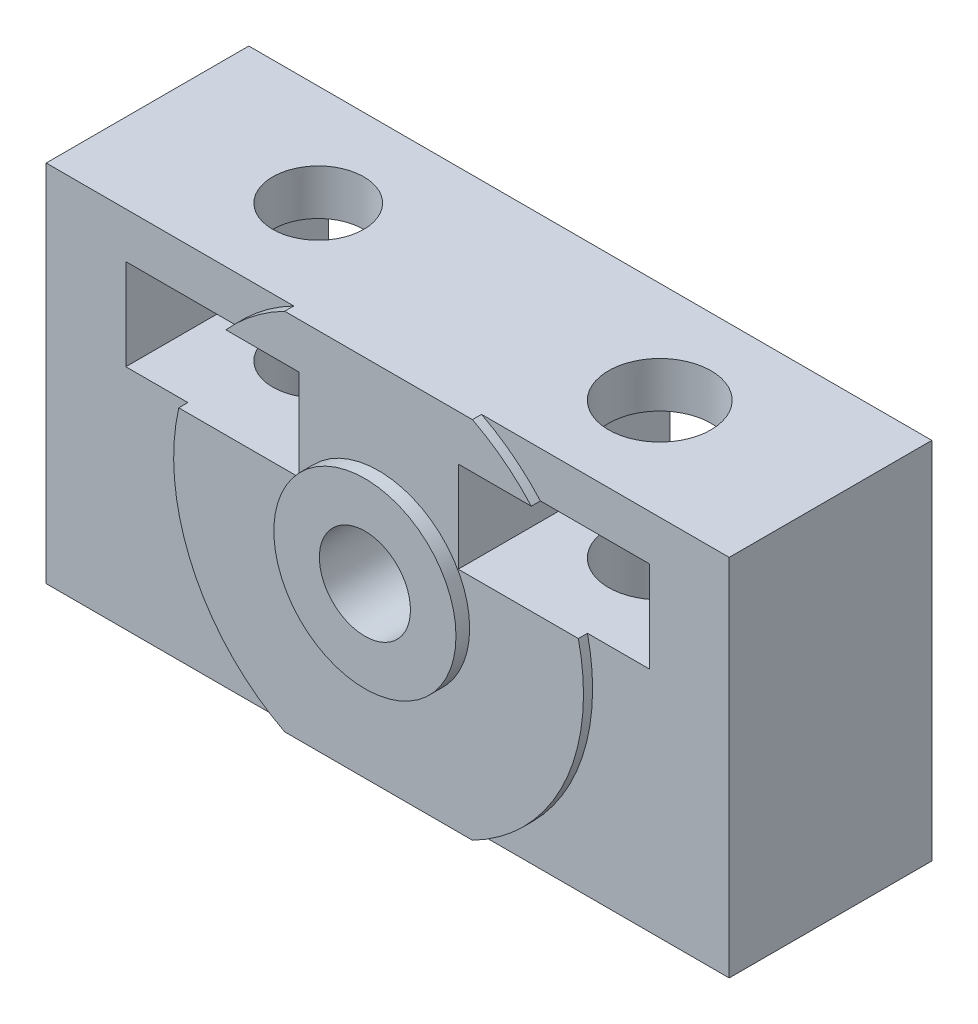
ISO-10303-21;
HEADER;
FILE_DESCRIPTION(('STEP AP214'),'2;1');
FILE_NAME('part.step','',(''),(''),'','','');
FILE_SCHEMA(('AUTOMOTIVE_DESIGN { 1 0 10303 214 1 1 1 1 }'));
ENDSEC;
DATA;
#1=APPLICATION_CONTEXT('core data for automotive mechanical design processes');
#2=APPLICATION_PROTOCOL_DEFINITION('international standard','automotive_design',2000,#1);
#3=PRODUCT_CONTEXT('',#1,'mechanical');
#4=PRODUCT('Part','Part','',(#3));
#5=PRODUCT_RELATED_PRODUCT_CATEGORY('part','',(#4));
#6=PRODUCT_DEFINITION_FORMATION('','',#4);
#7=PRODUCT_DEFINITION_CONTEXT('part definition',#1,'design');
#8=PRODUCT_DEFINITION('design','',#6,#7);
#9=PRODUCT_DEFINITION_SHAPE('','',#8);
#10=(LENGTH_UNIT() NAMED_UNIT(*) SI_UNIT(.MILLI.,.METRE.));
#11=(NAMED_UNIT(*) PLANE_ANGLE_UNIT() SI_UNIT($,.RADIAN.));
#12=(NAMED_UNIT(*) SI_UNIT($,.STERADIAN.) SOLID_ANGLE_UNIT());
#13=UNCERTAINTY_MEASURE_WITH_UNIT(LENGTH_MEASURE(1.E-05),#10,'distance_accuracy_value','');
#14=(GEOMETRIC_REPRESENTATION_CONTEXT(3) GLOBAL_UNCERTAINTY_ASSIGNED_CONTEXT((#13)) GLOBAL_UNIT_ASSIGNED_CONTEXT((#10,
#11,#12)) REPRESENTATION_CONTEXT('',''));
#15=CARTESIAN_POINT('',(0.,0.,0.));
#16=DIRECTION('',(0.,0.,1.));
#17=DIRECTION('',(1.,0.,0.));
#18=AXIS2_PLACEMENT_3D('',#15,#16,#17);
#19=CARTESIAN_POINT('',(-4.,0.,9.3));
#20=DIRECTION('',(0.,0.,-1.));
#21=DIRECTION('',(-1.,0.,0.));
#22=AXIS2_PLACEMENT_3D('',#19,#20,#21);
#23=PLANE('',#22);
#24=CARTESIAN_POINT('',(0.,0.,9.3));
#25=DIRECTION('',(0.,0.,1.));
#26=DIRECTION('',(1.,0.,0.));
#27=AXIS2_PLACEMENT_3D('',#24,#25,#26);
#28=CIRCLE('',#27,4.);
#29=CARTESIAN_POINT('',(4.,0.,9.3));
#30=VERTEX_POINT('',#29);
#31=EDGE_CURVE('E281',#30,#30,#28,.T.);
#32=ORIENTED_EDGE('',*,*,#31,.F.);
#33=EDGE_LOOP('',(#32));
#34=FACE_BOUND('',#33,.T.);
#35=DIRECTION('',(-1.,0.,0.));
#36=VECTOR('',#35,1.);
#37=CARTESIAN_POINT('',(-4.,-8.,9.3));
#38=LINE('',#37,#36);
#39=CARTESIAN_POINT('',(4.12310562561766,-8.,9.29999999999999));
#40=VERTEX_POINT('',#39);
#41=CARTESIAN_POINT('',(-4.12310562561766,-8.,9.3));
#42=VERTEX_POINT('',#41);
#43=EDGE_CURVE('E46',#40,#42,#38,.T.);
#44=ORIENTED_EDGE('',*,*,#43,.F.);
#45=CARTESIAN_POINT('',(0.,0.,9.3));
#46=DIRECTION('',(0.,0.,1.));
#47=DIRECTION('',(1.,0.,0.));
#48=AXIS2_PLACEMENT_3D('',#45,#46,#47);
#49=CIRCLE('',#48,9.);
#50=CARTESIAN_POINT('',(8.77496438739212,2.,9.29999999999999));
#51=VERTEX_POINT('',#50);
#52=EDGE_CURVE('E277',#40,#51,#49,.T.);
#53=ORIENTED_EDGE('',*,*,#52,.T.);
#54=DIRECTION('',(-1.,0.,0.));
#55=VECTOR('',#54,1.);
#56=CARTESIAN_POINT('',(-4.,2.,9.3));
#57=LINE('',#56,#55);
#58=CARTESIAN_POINT('',(3.5,2.,9.29999999999999));
#59=VERTEX_POINT('',#58);
#60=EDGE_CURVE('E479',#51,#59,#57,.T.);
#61=ORIENTED_EDGE('',*,*,#60,.T.);
#62=DIRECTION('',(0.,1.,0.));
#63=VECTOR('',#62,1.);
#64=CARTESIAN_POINT('',(3.5,0.,9.29999999999999));
#65=LINE('',#64,#63);
#66=CARTESIAN_POINT('',(3.5,6.,9.29999999999999));
#67=VERTEX_POINT('',#66);
#68=EDGE_CURVE('E245',#59,#67,#65,.T.);
#69=ORIENTED_EDGE('',*,*,#68,.T.);
#70=DIRECTION('',(1.,0.,0.));
#71=VECTOR('',#70,1.);
#72=CARTESIAN_POINT('',(-4.,6.,9.3));
#73=LINE('',#72,#71);
#74=CARTESIAN_POINT('',(6.70820393249937,6.,9.29999999999999));
#75=VERTEX_POINT('',#74);
#76=EDGE_CURVE('E276',#67,#75,#73,.T.);
#77=ORIENTED_EDGE('',*,*,#76,.T.);
#78=CARTESIAN_POINT('',(4.12310562561766,8.,9.3));
#79=VERTEX_POINT('',#78);
#80=EDGE_CURVE('E271',#75,#79,#49,.T.);
#81=ORIENTED_EDGE('',*,*,#80,.T.);
#82=DIRECTION('',(1.,0.,0.));
#83=VECTOR('',#82,1.);
#84=CARTESIAN_POINT('',(-4.,8.,9.3));
#85=LINE('',#84,#83);
#86=CARTESIAN_POINT('',(-4.12310562561767,8.,9.3));
#87=VERTEX_POINT('',#86);
#88=EDGE_CURVE('E175',#87,#79,#85,.T.);
#89=ORIENTED_EDGE('',*,*,#88,.F.);
#90=CARTESIAN_POINT('',(-6.70820393249937,6.,9.29999999999999));
#91=VERTEX_POINT('',#90);
#92=EDGE_CURVE('E227',#87,#91,#49,.T.);
#93=ORIENTED_EDGE('',*,*,#92,.T.);
#94=DIRECTION('',(1.,0.,0.));
#95=VECTOR('',#94,1.);
#96=CARTESIAN_POINT('',(-4.,6.,9.3));
#97=LINE('',#96,#95);
#98=CARTESIAN_POINT('',(-3.5,6.,9.3));
#99=VERTEX_POINT('',#98);
#100=EDGE_CURVE('E461',#91,#99,#97,.T.);
#101=ORIENTED_EDGE('',*,*,#100,.T.);
#102=DIRECTION('',(0.,-1.,0.));
#103=VECTOR('',#102,1.);
#104=CARTESIAN_POINT('',(-3.5,0.,9.3));
#105=LINE('',#104,#103);
#106=CARTESIAN_POINT('',(-3.5,2.,9.3));
#107=VERTEX_POINT('',#106);
#108=EDGE_CURVE('E242',#99,#107,#105,.T.);
#109=ORIENTED_EDGE('',*,*,#108,.T.);
#110=DIRECTION('',(-1.,0.,0.));
#111=VECTOR('',#110,1.);
#112=CARTESIAN_POINT('',(-4.,2.,9.3));
#113=LINE('',#112,#111);
#114=CARTESIAN_POINT('',(-8.77496438739212,2.,9.29999999999999));
#115=VERTEX_POINT('',#114);
#116=EDGE_CURVE('E457',#107,#115,#113,.T.);
#117=ORIENTED_EDGE('',*,*,#116,.T.);
#118=EDGE_CURVE('E279',#115,#42,#49,.T.);
#119=ORIENTED_EDGE('',*,*,#118,.T.);
#120=EDGE_LOOP('',(#44,#53,#61,#69,#77,#81,#89,#93,#101,#109,#117,#119));
#121=FACE_BOUND('',#120,.T.);
#122=ADVANCED_FACE('F32',(#34,#121),#23,.F.);
#123=CARTESIAN_POINT('',(0.,0.,8.9));
#124=DIRECTION('',(0.,0.,1.));
#125=DIRECTION('',(1.,0.,0.));
#126=AXIS2_PLACEMENT_3D('',#123,#124,#125);
#127=CYLINDRICAL_SURFACE('',#126,9.);
#128=DIRECTION('',(0.,0.,1.));
#129=VECTOR('',#128,1.);
#130=CARTESIAN_POINT('',(4.12310562561766,-8.,8.9));
#131=LINE('',#130,#129);
#132=CARTESIAN_POINT('',(4.12310562561766,-8.,8.9));
#133=VERTEX_POINT('',#132);
#134=EDGE_CURVE('E11',#133,#40,#131,.T.);
#135=ORIENTED_EDGE('',*,*,#134,.F.);
#136=CARTESIAN_POINT('',(0.,0.,8.9));
#137=DIRECTION('',(0.,0.,1.));
#138=DIRECTION('',(1.,0.,0.));
#139=AXIS2_PLACEMENT_3D('',#136,#137,#138);
#140=CIRCLE('',#139,9.);
#141=CARTESIAN_POINT('',(8.77496438739212,2.,8.9));
#142=VERTEX_POINT('',#141);
#143=EDGE_CURVE('E184',#133,#142,#140,.T.);
#144=ORIENTED_EDGE('',*,*,#143,.T.);
#145=DIRECTION('',(0.,0.,1.));
#146=VECTOR('',#145,1.);
#147=CARTESIAN_POINT('',(8.77496438739212,2.,8.9));
#148=LINE('',#147,#146);
#149=EDGE_CURVE('E249',#142,#51,#148,.T.);
#150=ORIENTED_EDGE('',*,*,#149,.T.);
#151=ORIENTED_EDGE('',*,*,#52,.F.);
#152=EDGE_LOOP('',(#135,#144,#150,#151));
#153=FACE_BOUND('',#152,.T.);
#154=ADVANCED_FACE('F322',(#153),#127,.T.);
#155=DIRECTION('',(0.,0.,1.));
#156=VECTOR('',#155,1.);
#157=CARTESIAN_POINT('',(-4.12310562561766,-8.,8.90000000000001));
#158=LINE('',#157,#156);
#159=CARTESIAN_POINT('',(-4.12310562561766,-8.,8.9));
#160=VERTEX_POINT('',#159);
#161=EDGE_CURVE('E40',#42,#160,#158,.F.);
#162=ORIENTED_EDGE('',*,*,#161,.F.);
#163=ORIENTED_EDGE('',*,*,#118,.F.);
#164=DIRECTION('',(0.,0.,1.));
#165=VECTOR('',#164,1.);
#166=CARTESIAN_POINT('',(-8.77496438739212,2.,8.90000000000001));
#167=LINE('',#166,#165);
#168=CARTESIAN_POINT('',(-8.77496438739212,2.,8.90000000000001));
#169=VERTEX_POINT('',#168);
#170=EDGE_CURVE('E180',#115,#169,#167,.F.);
#171=ORIENTED_EDGE('',*,*,#170,.T.);
#172=EDGE_CURVE('E178',#169,#160,#140,.T.);
#173=ORIENTED_EDGE('',*,*,#172,.T.);
#174=EDGE_LOOP('',(#162,#163,#171,#173));
#175=FACE_BOUND('',#174,.T.);
#176=ADVANCED_FACE('F179',(#175),#127,.T.);
#177=DIRECTION('',(0.,0.,-1.));
#178=VECTOR('',#177,1.);
#179=CARTESIAN_POINT('',(-4.12310562561766,8.,9.9));
#180=LINE('',#179,#178);
#181=CARTESIAN_POINT('',(-4.12310562561766,8.,8.9));
#182=VERTEX_POINT('',#181);
#183=EDGE_CURVE('E54',#87,#182,#180,.T.);
#184=ORIENTED_EDGE('',*,*,#183,.T.);
#185=CARTESIAN_POINT('',(-6.70820393249937,6.,8.9));
#186=VERTEX_POINT('',#185);
#187=EDGE_CURVE('E183',#182,#186,#140,.T.);
#188=ORIENTED_EDGE('',*,*,#187,.T.);
#189=DIRECTION('',(0.,0.,1.));
#190=VECTOR('',#189,1.);
#191=CARTESIAN_POINT('',(-6.70820393249937,6.,8.90000000000001));
#192=LINE('',#191,#190);
#193=EDGE_CURVE('E240',#186,#91,#192,.T.);
#194=ORIENTED_EDGE('',*,*,#193,.T.);
#195=ORIENTED_EDGE('',*,*,#92,.F.);
#196=EDGE_LOOP('',(#184,#188,#194,#195));
#197=FACE_BOUND('',#196,.T.);
#198=ADVANCED_FACE('F406',(#197),#127,.T.);
#199=DIRECTION('',(0.,0.,-1.));
#200=VECTOR('',#199,1.);
#201=CARTESIAN_POINT('',(4.12310562561766,8.,9.9));
#202=LINE('',#201,#200);
#203=CARTESIAN_POINT('',(4.12310562561766,8.,8.9));
#204=VERTEX_POINT('',#203);
#205=EDGE_CURVE('E262',#79,#204,#202,.T.);
#206=ORIENTED_EDGE('',*,*,#205,.F.);
#207=ORIENTED_EDGE('',*,*,#80,.F.);
#208=DIRECTION('',(0.,0.,1.));
#209=VECTOR('',#208,1.);
#210=CARTESIAN_POINT('',(6.70820393249937,6.,8.9));
#211=LINE('',#210,#209);
#212=CARTESIAN_POINT('',(6.70820393249937,6.,8.9));
#213=VERTEX_POINT('',#212);
#214=EDGE_CURVE('E254',#75,#213,#211,.F.);
#215=ORIENTED_EDGE('',*,*,#214,.T.);
#216=EDGE_CURVE('E186',#213,#204,#140,.T.);
#217=ORIENTED_EDGE('',*,*,#216,.T.);
#218=EDGE_LOOP('',(#206,#207,#215,#217));
#219=FACE_BOUND('',#218,.T.);
#220=ADVANCED_FACE('F269',(#219),#127,.T.);
#221=CARTESIAN_POINT('',(7.5,9.,4.45));
#222=DIRECTION('',(0.,-1.,0.));
#223=DIRECTION('',(1.,0.,0.));
#224=AXIS2_PLACEMENT_3D('',#221,#222,#223);
#225=CYLINDRICAL_SURFACE('',#224,2.25);
#226=CARTESIAN_POINT('',(7.5,6.,4.45));
#227=DIRECTION('',(0.,1.,0.));
#228=DIRECTION('',(-1.,0.,0.));
#229=AXIS2_PLACEMENT_3D('',#226,#227,#228);
#230=CIRCLE('',#229,2.25);
#231=CARTESIAN_POINT('',(5.25,6.,4.45));
#232=VERTEX_POINT('',#231);
#233=EDGE_CURVE('E251',#232,#232,#230,.F.);
#234=ORIENTED_EDGE('',*,*,#233,.T.);
#235=EDGE_LOOP('',(#234));
#236=FACE_BOUND('',#235,.T.);
#237=CARTESIAN_POINT('',(7.5,8.,4.45));
#238=DIRECTION('',(0.,-1.,0.));
#239=DIRECTION('',(1.,0.,0.));
#240=AXIS2_PLACEMENT_3D('',#237,#238,#239);
#241=CIRCLE('',#240,2.25);
#242=CARTESIAN_POINT('',(9.75,8.,4.45));
#243=VERTEX_POINT('',#242);
#244=EDGE_CURVE('E229',#243,#243,#241,.T.);
#245=ORIENTED_EDGE('',*,*,#244,.F.);
#246=EDGE_LOOP('',(#245));
#247=FACE_BOUND('',#246,.T.);
#248=ADVANCED_FACE('F334',(#236,#247),#225,.F.);
#249=CARTESIAN_POINT('',(-7.5,9.,4.45));
#250=DIRECTION('',(0.,-1.,0.));
#251=DIRECTION('',(1.,0.,0.));
#252=AXIS2_PLACEMENT_3D('',#249,#250,#251);
#253=CYLINDRICAL_SURFACE('',#252,2.);
#254=CARTESIAN_POINT('',(-7.5,6.,4.45));
#255=DIRECTION('',(0.,1.,0.));
#256=DIRECTION('',(-1.,0.,0.));
#257=AXIS2_PLACEMENT_3D('',#254,#255,#256);
#258=CIRCLE('',#257,2.);
#259=CARTESIAN_POINT('',(-9.5,6.,4.45));
#260=VERTEX_POINT('',#259);
#261=EDGE_CURVE('E237',#260,#260,#258,.F.);
#262=ORIENTED_EDGE('',*,*,#261,.T.);
#263=EDGE_LOOP('',(#262));
#264=FACE_BOUND('',#263,.T.);
#265=CARTESIAN_POINT('',(-7.5,8.,4.45));
#266=DIRECTION('',(0.,-1.,0.));
#267=DIRECTION('',(1.,0.,0.));
#268=AXIS2_PLACEMENT_3D('',#265,#266,#267);
#269=CIRCLE('',#268,2.);
#270=CARTESIAN_POINT('',(-5.5,8.,4.45));
#271=VERTEX_POINT('',#270);
#272=EDGE_CURVE('E224',#271,#271,#269,.T.);
#273=ORIENTED_EDGE('',*,*,#272,.F.);
#274=EDGE_LOOP('',(#273));
#275=FACE_BOUND('',#274,.T.);
#276=ADVANCED_FACE('F319',(#264,#275),#253,.F.);
#277=CARTESIAN_POINT('',(-15.,8.,8.9));
#278=DIRECTION('',(0.,0.,1.));
#279=DIRECTION('',(1.,0.,0.));
#280=AXIS2_PLACEMENT_3D('',#277,#278,#279);
#281=PLANE('',#280);
#282=DIRECTION('',(-1.,0.,0.));
#283=VECTOR('',#282,1.);
#284=CARTESIAN_POINT('',(-15.,6.,8.9));
#285=LINE('',#284,#283);
#286=CARTESIAN_POINT('',(-11.5,6.,8.9));
#287=VERTEX_POINT('',#286);
#288=EDGE_CURVE('E409',#186,#287,#285,.T.);
#289=ORIENTED_EDGE('',*,*,#288,.F.);
#290=ORIENTED_EDGE('',*,*,#187,.F.);
#291=DIRECTION('',(-1.,0.,0.));
#292=VECTOR('',#291,1.);
#293=CARTESIAN_POINT('',(15.,8.,8.9));
#294=LINE('',#293,#292);
#295=CARTESIAN_POINT('',(-15.,8.,8.9));
#296=VERTEX_POINT('',#295);
#297=EDGE_CURVE('E195',#182,#296,#294,.T.);
#298=ORIENTED_EDGE('',*,*,#297,.T.);
#299=DIRECTION('',(0.,-1.,0.));
#300=VECTOR('',#299,1.);
#301=CARTESIAN_POINT('',(-15.,-8.,8.9));
#302=LINE('',#301,#300);
#303=CARTESIAN_POINT('',(-15.,-8.,8.9));
#304=VERTEX_POINT('',#303);
#305=EDGE_CURVE('E190',#296,#304,#302,.T.);
#306=ORIENTED_EDGE('',*,*,#305,.T.);
#307=DIRECTION('',(1.,0.,0.));
#308=VECTOR('',#307,1.);
#309=CARTESIAN_POINT('',(15.,-8.,8.9));
#310=LINE('',#309,#308);
#311=EDGE_CURVE('E170',#304,#160,#310,.T.);
#312=ORIENTED_EDGE('',*,*,#311,.T.);
#313=ORIENTED_EDGE('',*,*,#172,.F.);
#314=DIRECTION('',(1.,0.,0.));
#315=VECTOR('',#314,1.);
#316=CARTESIAN_POINT('',(-15.,2.,8.9));
#317=LINE('',#316,#315);
#318=CARTESIAN_POINT('',(-11.5,2.,8.9));
#319=VERTEX_POINT('',#318);
#320=EDGE_CURVE('E241',#319,#169,#317,.T.);
#321=ORIENTED_EDGE('',*,*,#320,.F.);
#322=DIRECTION('',(0.,-1.,0.));
#323=VECTOR('',#322,1.);
#324=CARTESIAN_POINT('',(-11.5,8.,8.9));
#325=LINE('',#324,#323);
#326=EDGE_CURVE('E464',#287,#319,#325,.T.);
#327=ORIENTED_EDGE('',*,*,#326,.F.);
#328=EDGE_LOOP('',(#289,#290,#298,#306,#312,#313,#321,#327));
#329=FACE_BOUND('',#328,.T.);
#330=ADVANCED_FACE('F188',(#329),#281,.T.);
#331=DIRECTION('',(-1.,0.,0.));
#332=VECTOR('',#331,1.);
#333=CARTESIAN_POINT('',(-15.,6.,8.9));
#334=LINE('',#333,#332);
#335=CARTESIAN_POINT('',(11.5,6.,8.9));
#336=VERTEX_POINT('',#335);
#337=EDGE_CURVE('E370',#336,#213,#334,.T.);
#338=ORIENTED_EDGE('',*,*,#337,.F.);
#339=DIRECTION('',(0.,1.,0.));
#340=VECTOR('',#339,1.);
#341=CARTESIAN_POINT('',(11.5,8.,8.9));
#342=LINE('',#341,#340);
#343=CARTESIAN_POINT('',(11.5,2.,8.9));
#344=VERTEX_POINT('',#343);
#345=EDGE_CURVE('E471',#344,#336,#342,.T.);
#346=ORIENTED_EDGE('',*,*,#345,.F.);
#347=DIRECTION('',(1.,0.,0.));
#348=VECTOR('',#347,1.);
#349=CARTESIAN_POINT('',(-15.,2.,8.9));
#350=LINE('',#349,#348);
#351=EDGE_CURVE('E255',#142,#344,#350,.T.);
#352=ORIENTED_EDGE('',*,*,#351,.F.);
#353=ORIENTED_EDGE('',*,*,#143,.F.);
#354=CARTESIAN_POINT('',(15.,-8.,8.9));
#355=VERTEX_POINT('',#354);
#356=EDGE_CURVE('E193',#133,#355,#310,.T.);
#357=ORIENTED_EDGE('',*,*,#356,.T.);
#358=DIRECTION('',(0.,1.,0.));
#359=VECTOR('',#358,1.);
#360=CARTESIAN_POINT('',(15.,-8.,8.9));
#361=LINE('',#360,#359);
#362=CARTESIAN_POINT('',(15.,8.,8.9));
#363=VERTEX_POINT('',#362);
#364=EDGE_CURVE('E192',#355,#363,#361,.T.);
#365=ORIENTED_EDGE('',*,*,#364,.T.);
#366=EDGE_CURVE('E200',#363,#204,#294,.T.);
#367=ORIENTED_EDGE('',*,*,#366,.T.);
#368=ORIENTED_EDGE('',*,*,#216,.F.);
#369=EDGE_LOOP('',(#338,#346,#352,#353,#357,#365,#367,#368));
#370=FACE_BOUND('',#369,.T.);
#371=ADVANCED_FACE('F419',(#370),#281,.T.);
#372=CARTESIAN_POINT('',(-15.,8.,0.));
#373=DIRECTION('',(0.,0.,1.));
#374=DIRECTION('',(1.,0.,0.));
#375=AXIS2_PLACEMENT_3D('',#372,#373,#374);
#376=PLANE('',#375);
#377=DIRECTION('',(-1.,0.,0.));
#378=VECTOR('',#377,1.);
#379=CARTESIAN_POINT('',(11.5,6.,0.));
#380=LINE('',#379,#378);
#381=CARTESIAN_POINT('',(11.5,6.,0.));
#382=VERTEX_POINT('',#381);
#383=CARTESIAN_POINT('',(3.5,6.,0.));
#384=VERTEX_POINT('',#383);
#385=EDGE_CURVE('E430',#382,#384,#380,.T.);
#386=ORIENTED_EDGE('',*,*,#385,.T.);
#387=DIRECTION('',(0.,-1.,0.));
#388=VECTOR('',#387,1.);
#389=CARTESIAN_POINT('',(3.5,2.,0.));
#390=LINE('',#389,#388);
#391=CARTESIAN_POINT('',(3.5,2.,0.));
#392=VERTEX_POINT('',#391);
#393=EDGE_CURVE('E273',#384,#392,#390,.T.);
#394=ORIENTED_EDGE('',*,*,#393,.T.);
#395=DIRECTION('',(1.,0.,0.));
#396=VECTOR('',#395,1.);
#397=CARTESIAN_POINT('',(11.5,2.,0.));
#398=LINE('',#397,#396);
#399=CARTESIAN_POINT('',(11.5,2.,0.));
#400=VERTEX_POINT('',#399);
#401=EDGE_CURVE('E496',#392,#400,#398,.T.);
#402=ORIENTED_EDGE('',*,*,#401,.T.);
#403=DIRECTION('',(0.,1.,0.));
#404=VECTOR('',#403,1.);
#405=CARTESIAN_POINT('',(11.5,2.,0.));
#406=LINE('',#405,#404);
#407=EDGE_CURVE('E494',#400,#382,#406,.T.);
#408=ORIENTED_EDGE('',*,*,#407,.T.);
#409=EDGE_LOOP('',(#386,#394,#402,#408));
#410=FACE_BOUND('',#409,.T.);
#411=DIRECTION('',(-1.,0.,0.));
#412=VECTOR('',#411,1.);
#413=CARTESIAN_POINT('',(-3.5,6.,0.));
#414=LINE('',#413,#412);
#415=CARTESIAN_POINT('',(-3.5,6.,0.));
#416=VERTEX_POINT('',#415);
#417=CARTESIAN_POINT('',(-11.5,6.,0.));
#418=VERTEX_POINT('',#417);
#419=EDGE_CURVE('E435',#416,#418,#414,.T.);
#420=ORIENTED_EDGE('',*,*,#419,.T.);
#421=DIRECTION('',(0.,-1.,0.));
#422=VECTOR('',#421,1.);
#423=CARTESIAN_POINT('',(-11.5,2.,0.));
#424=LINE('',#423,#422);
#425=CARTESIAN_POINT('',(-11.5,2.,0.));
#426=VERTEX_POINT('',#425);
#427=EDGE_CURVE('E438',#418,#426,#424,.T.);
#428=ORIENTED_EDGE('',*,*,#427,.T.);
#429=DIRECTION('',(1.,0.,0.));
#430=VECTOR('',#429,1.);
#431=CARTESIAN_POINT('',(-3.5,2.,0.));
#432=LINE('',#431,#430);
#433=CARTESIAN_POINT('',(-3.5,2.,0.));
#434=VERTEX_POINT('',#433);
#435=EDGE_CURVE('E446',#426,#434,#432,.T.);
#436=ORIENTED_EDGE('',*,*,#435,.T.);
#437=DIRECTION('',(0.,1.,0.));
#438=VECTOR('',#437,1.);
#439=CARTESIAN_POINT('',(-3.5,2.,0.));
#440=LINE('',#439,#438);
#441=EDGE_CURVE('E439',#434,#416,#440,.T.);
#442=ORIENTED_EDGE('',*,*,#441,.T.);
#443=EDGE_LOOP('',(#420,#428,#436,#442));
#444=FACE_BOUND('',#443,.T.);
#445=DIRECTION('',(0.,-1.,0.));
#446=VECTOR('',#445,1.);
#447=CARTESIAN_POINT('',(-15.,-8.,0.));
#448=LINE('',#447,#446);
#449=CARTESIAN_POINT('',(-15.,8.,0.));
#450=VERTEX_POINT('',#449);
#451=CARTESIAN_POINT('',(-15.,-8.,0.));
#452=VERTEX_POINT('',#451);
#453=EDGE_CURVE('E204',#450,#452,#448,.T.);
#454=ORIENTED_EDGE('',*,*,#453,.F.);
#455=DIRECTION('',(-1.,0.,0.));
#456=VECTOR('',#455,1.);
#457=CARTESIAN_POINT('',(15.,8.,0.));
#458=LINE('',#457,#456);
#459=CARTESIAN_POINT('',(15.,8.,0.));
#460=VERTEX_POINT('',#459);
#461=EDGE_CURVE('E212',#460,#450,#458,.T.);
#462=ORIENTED_EDGE('',*,*,#461,.F.);
#463=DIRECTION('',(0.,1.,0.));
#464=VECTOR('',#463,1.);
#465=CARTESIAN_POINT('',(15.,-8.,0.));
#466=LINE('',#465,#464);
#467=CARTESIAN_POINT('',(15.,-8.,0.));
#468=VERTEX_POINT('',#467);
#469=EDGE_CURVE('E210',#468,#460,#466,.T.);
#470=ORIENTED_EDGE('',*,*,#469,.F.);
#471=DIRECTION('',(1.,0.,0.));
#472=VECTOR('',#471,1.);
#473=CARTESIAN_POINT('',(15.,-8.,0.));
#474=LINE('',#473,#472);
#475=EDGE_CURVE('E207',#452,#468,#474,.T.);
#476=ORIENTED_EDGE('',*,*,#475,.F.);
#477=EDGE_LOOP('',(#454,#462,#470,#476));
#478=FACE_BOUND('',#477,.T.);
#479=CARTESIAN_POINT('',(0.,0.,0.));
#480=DIRECTION('',(0.,0.,1.));
#481=DIRECTION('',(1.,0.,0.));
#482=AXIS2_PLACEMENT_3D('',#479,#480,#481);
#483=CIRCLE('',#482,2.);
#484=CARTESIAN_POINT('',(2.,0.,0.));
#485=VERTEX_POINT('',#484);
#486=EDGE_CURVE('E208',#485,#485,#483,.T.);
#487=ORIENTED_EDGE('',*,*,#486,.T.);
#488=EDGE_LOOP('',(#487));
#489=FACE_BOUND('',#488,.T.);
#490=ADVANCED_FACE('F295',(#410,#444,#478,#489),#376,.F.);
#491=CARTESIAN_POINT('',(-15.,-8.,8.9));
#492=DIRECTION('',(1.,0.,0.));
#493=DIRECTION('',(0.,0.,-1.));
#494=AXIS2_PLACEMENT_3D('',#491,#492,#493);
#495=PLANE('',#494);
#496=ORIENTED_EDGE('',*,*,#453,.T.);
#497=DIRECTION('',(0.,0.,-1.));
#498=VECTOR('',#497,1.);
#499=CARTESIAN_POINT('',(-15.,-8.,8.9));
#500=LINE('',#499,#498);
#501=EDGE_CURVE('E222',#304,#452,#500,.T.);
#502=ORIENTED_EDGE('',*,*,#501,.F.);
#503=ORIENTED_EDGE('',*,*,#305,.F.);
#504=DIRECTION('',(0.,0.,-1.));
#505=VECTOR('',#504,1.);
#506=CARTESIAN_POINT('',(-15.,8.,8.9));
#507=LINE('',#506,#505);
#508=EDGE_CURVE('E203',#296,#450,#507,.T.);
#509=ORIENTED_EDGE('',*,*,#508,.T.);
#510=EDGE_LOOP('',(#496,#502,#503,#509));
#511=FACE_BOUND('',#510,.T.);
#512=ADVANCED_FACE('F34',(#511),#495,.F.);
#513=CARTESIAN_POINT('',(15.,-8.,8.9));
#514=DIRECTION('',(0.,1.,0.));
#515=DIRECTION('',(-1.,0.,0.));
#516=AXIS2_PLACEMENT_3D('',#513,#514,#515);
#517=PLANE('',#516);
#518=CARTESIAN_POINT('',(-7.5,-8.,4.45));
#519=DIRECTION('',(0.,-1.,0.));
#520=DIRECTION('',(1.,0.,0.));
#521=AXIS2_PLACEMENT_3D('',#518,#519,#520);
#522=CIRCLE('',#521,2.);
#523=CARTESIAN_POINT('',(-5.5,-8.,4.45));
#524=VERTEX_POINT('',#523);
#525=EDGE_CURVE('E228',#524,#524,#522,.T.);
#526=ORIENTED_EDGE('',*,*,#525,.F.);
#527=EDGE_LOOP('',(#526));
#528=FACE_BOUND('',#527,.T.);
#529=ORIENTED_EDGE('',*,*,#475,.T.);
#530=DIRECTION('',(0.,0.,-1.));
#531=VECTOR('',#530,1.);
#532=CARTESIAN_POINT('',(15.,-8.,8.9));
#533=LINE('',#532,#531);
#534=EDGE_CURVE('E219',#355,#468,#533,.T.);
#535=ORIENTED_EDGE('',*,*,#534,.F.);
#536=ORIENTED_EDGE('',*,*,#356,.F.);
#537=ORIENTED_EDGE('',*,*,#134,.T.);
#538=ORIENTED_EDGE('',*,*,#43,.T.);
#539=ORIENTED_EDGE('',*,*,#161,.T.);
#540=ORIENTED_EDGE('',*,*,#311,.F.);
#541=ORIENTED_EDGE('',*,*,#501,.T.);
#542=EDGE_LOOP('',(#529,#535,#536,#537,#538,#539,#540,#541));
#543=FACE_BOUND('',#542,.T.);
#544=CARTESIAN_POINT('',(7.5,-8.,4.45));
#545=DIRECTION('',(0.,-1.,0.));
#546=DIRECTION('',(1.,0.,0.));
#547=AXIS2_PLACEMENT_3D('',#544,#545,#546);
#548=CIRCLE('',#547,2.25);
#549=CARTESIAN_POINT('',(9.75,-8.,4.45));
#550=VERTEX_POINT('',#549);
#551=EDGE_CURVE('E232',#550,#550,#548,.T.);
#552=ORIENTED_EDGE('',*,*,#551,.F.);
#553=EDGE_LOOP('',(#552));
#554=FACE_BOUND('',#553,.T.);
#555=ADVANCED_FACE('F166',(#528,#543,#554),#517,.F.);
#556=CARTESIAN_POINT('',(15.,-8.,8.9));
#557=DIRECTION('',(-1.,0.,0.));
#558=DIRECTION('',(0.,0.,1.));
#559=AXIS2_PLACEMENT_3D('',#556,#557,#558);
#560=PLANE('',#559);
#561=ORIENTED_EDGE('',*,*,#469,.T.);
#562=DIRECTION('',(0.,0.,-1.));
#563=VECTOR('',#562,1.);
#564=CARTESIAN_POINT('',(15.,8.,8.9));
#565=LINE('',#564,#563);
#566=EDGE_CURVE('E216',#363,#460,#565,.T.);
#567=ORIENTED_EDGE('',*,*,#566,.F.);
#568=ORIENTED_EDGE('',*,*,#364,.F.);
#569=ORIENTED_EDGE('',*,*,#534,.T.);
#570=EDGE_LOOP('',(#561,#567,#568,#569));
#571=FACE_BOUND('',#570,.T.);
#572=ADVANCED_FACE('F378',(#571),#560,.F.);
#573=CARTESIAN_POINT('',(15.,8.,8.9));
#574=DIRECTION('',(0.,-1.,0.));
#575=DIRECTION('',(1.,0.,0.));
#576=AXIS2_PLACEMENT_3D('',#573,#574,#575);
#577=PLANE('',#576);
#578=ORIENTED_EDGE('',*,*,#244,.T.);
#579=EDGE_LOOP('',(#578));
#580=FACE_BOUND('',#579,.T.);
#581=ORIENTED_EDGE('',*,*,#461,.T.);
#582=ORIENTED_EDGE('',*,*,#508,.F.);
#583=ORIENTED_EDGE('',*,*,#297,.F.);
#584=ORIENTED_EDGE('',*,*,#183,.F.);
#585=ORIENTED_EDGE('',*,*,#88,.T.);
#586=ORIENTED_EDGE('',*,*,#205,.T.);
#587=ORIENTED_EDGE('',*,*,#366,.F.);
#588=ORIENTED_EDGE('',*,*,#566,.T.);
#589=EDGE_LOOP('',(#581,#582,#583,#584,#585,#586,#587,#588));
#590=FACE_BOUND('',#589,.T.);
#591=ORIENTED_EDGE('',*,*,#272,.T.);
#592=EDGE_LOOP('',(#591));
#593=FACE_BOUND('',#592,.T.);
#594=ADVANCED_FACE('F259',(#580,#590,#593),#577,.F.);
#595=CARTESIAN_POINT('',(0.,0.,8.9));
#596=DIRECTION('',(0.,0.,-1.));
#597=DIRECTION('',(-1.,0.,0.));
#598=AXIS2_PLACEMENT_3D('',#595,#596,#597);
#599=CYLINDRICAL_SURFACE('',#598,2.);
#600=ORIENTED_EDGE('',*,*,#486,.F.);
#601=EDGE_LOOP('',(#600));
#602=FACE_BOUND('',#601,.T.);
#603=CARTESIAN_POINT('',(0.,0.,9.9));
#604=DIRECTION('',(0.,0.,1.));
#605=DIRECTION('',(1.,0.,0.));
#606=AXIS2_PLACEMENT_3D('',#603,#604,#605);
#607=CIRCLE('',#606,2.);
#608=CARTESIAN_POINT('',(2.,0.,9.9));
#609=VERTEX_POINT('',#608);
#610=EDGE_CURVE('E288',#609,#609,#607,.T.);
#611=ORIENTED_EDGE('',*,*,#610,.T.);
#612=EDGE_LOOP('',(#611));
#613=FACE_BOUND('',#612,.T.);
#614=ADVANCED_FACE('F297',(#602,#613),#599,.F.);
#615=CARTESIAN_POINT('',(-2.,0.,9.9));
#616=DIRECTION('',(0.,0.,-1.));
#617=DIRECTION('',(-1.,0.,0.));
#618=AXIS2_PLACEMENT_3D('',#615,#616,#617);
#619=PLANE('',#618);
#620=ORIENTED_EDGE('',*,*,#610,.F.);
#621=EDGE_LOOP('',(#620));
#622=FACE_BOUND('',#621,.T.);
#623=CARTESIAN_POINT('',(0.,0.,9.9));
#624=DIRECTION('',(0.,0.,1.));
#625=DIRECTION('',(1.,0.,0.));
#626=AXIS2_PLACEMENT_3D('',#623,#624,#625);
#627=CIRCLE('',#626,4.);
#628=CARTESIAN_POINT('',(4.,0.,9.9));
#629=VERTEX_POINT('',#628);
#630=EDGE_CURVE('E284',#629,#629,#627,.T.);
#631=ORIENTED_EDGE('',*,*,#630,.T.);
#632=EDGE_LOOP('',(#631));
#633=FACE_BOUND('',#632,.T.);
#634=ADVANCED_FACE('F300',(#622,#633),#619,.F.);
#635=CARTESIAN_POINT('',(0.,0.,8.9));
#636=DIRECTION('',(0.,0.,1.));
#637=DIRECTION('',(1.,0.,0.));
#638=AXIS2_PLACEMENT_3D('',#635,#636,#637);
#639=CYLINDRICAL_SURFACE('',#638,4.);
#640=ORIENTED_EDGE('',*,*,#630,.F.);
#641=EDGE_LOOP('',(#640));
#642=FACE_BOUND('',#641,.T.);
#643=ORIENTED_EDGE('',*,*,#31,.T.);
#644=EDGE_LOOP('',(#643));
#645=FACE_BOUND('',#644,.T.);
#646=ADVANCED_FACE('F306',(#642,#645),#639,.T.);
#647=CARTESIAN_POINT('',(-7.5,2.,4.45));
#648=DIRECTION('',(0.,-1.,0.));
#649=DIRECTION('',(1.,0.,0.));
#650=AXIS2_PLACEMENT_3D('',#647,#648,#649);
#651=CIRCLE('',#650,2.);
#652=CARTESIAN_POINT('',(-5.5,2.,4.45));
#653=VERTEX_POINT('',#652);
#654=EDGE_CURVE('E233',#653,#653,#651,.F.);
#655=ORIENTED_EDGE('',*,*,#654,.T.);
#656=EDGE_LOOP('',(#655));
#657=FACE_BOUND('',#656,.T.);
#658=ORIENTED_EDGE('',*,*,#525,.T.);
#659=EDGE_LOOP('',(#658));
#660=FACE_BOUND('',#659,.T.);
#661=ADVANCED_FACE('F311',(#657,#660),#253,.F.);
#662=CARTESIAN_POINT('',(7.5,2.,4.45));
#663=DIRECTION('',(0.,-1.,0.));
#664=DIRECTION('',(1.,0.,0.));
#665=AXIS2_PLACEMENT_3D('',#662,#663,#664);
#666=CIRCLE('',#665,2.25);
#667=CARTESIAN_POINT('',(9.75,2.,4.45));
#668=VERTEX_POINT('',#667);
#669=EDGE_CURVE('E246',#668,#668,#666,.F.);
#670=ORIENTED_EDGE('',*,*,#669,.T.);
#671=EDGE_LOOP('',(#670));
#672=FACE_BOUND('',#671,.T.);
#673=ORIENTED_EDGE('',*,*,#551,.T.);
#674=EDGE_LOOP('',(#673));
#675=FACE_BOUND('',#674,.T.);
#676=ADVANCED_FACE('F316',(#672,#675),#225,.F.);
#677=CARTESIAN_POINT('',(-3.5,2.,0.));
#678=DIRECTION('',(1.,0.,0.));
#679=DIRECTION('',(0.,0.,-1.));
#680=AXIS2_PLACEMENT_3D('',#677,#678,#679);
#681=PLANE('',#680);
#682=DIRECTION('',(0.,0.,1.));
#683=VECTOR('',#682,1.);
#684=CARTESIAN_POINT('',(-3.5,6.,0.));
#685=LINE('',#684,#683);
#686=EDGE_CURVE('E452',#416,#99,#685,.T.);
#687=ORIENTED_EDGE('',*,*,#686,.F.);
#688=ORIENTED_EDGE('',*,*,#441,.F.);
#689=DIRECTION('',(0.,0.,1.));
#690=VECTOR('',#689,1.);
#691=CARTESIAN_POINT('',(-3.5,2.,0.));
#692=LINE('',#691,#690);
#693=EDGE_CURVE('E444',#434,#107,#692,.T.);
#694=ORIENTED_EDGE('',*,*,#693,.T.);
#695=ORIENTED_EDGE('',*,*,#108,.F.);
#696=EDGE_LOOP('',(#687,#688,#694,#695));
#697=FACE_BOUND('',#696,.T.);
#698=ADVANCED_FACE('F332',(#697),#681,.F.);
#699=CARTESIAN_POINT('',(-3.5,6.,0.));
#700=DIRECTION('',(0.,1.,0.));
#701=DIRECTION('',(-1.,0.,0.));
#702=AXIS2_PLACEMENT_3D('',#699,#700,#701);
#703=PLANE('',#702);
#704=ORIENTED_EDGE('',*,*,#288,.T.);
#705=DIRECTION('',(0.,0.,1.));
#706=VECTOR('',#705,1.);
#707=CARTESIAN_POINT('',(-11.5,6.,0.));
#708=LINE('',#707,#706);
#709=EDGE_CURVE('E236',#418,#287,#708,.T.);
#710=ORIENTED_EDGE('',*,*,#709,.F.);
#711=ORIENTED_EDGE('',*,*,#419,.F.);
#712=ORIENTED_EDGE('',*,*,#686,.T.);
#713=ORIENTED_EDGE('',*,*,#100,.F.);
#714=ORIENTED_EDGE('',*,*,#193,.F.);
#715=EDGE_LOOP('',(#704,#710,#711,#712,#713,#714));
#716=FACE_BOUND('',#715,.T.);
#717=ORIENTED_EDGE('',*,*,#261,.F.);
#718=EDGE_LOOP('',(#717));
#719=FACE_BOUND('',#718,.T.);
#720=ADVANCED_FACE('F343',(#716,#719),#703,.F.);
#721=CARTESIAN_POINT('',(-3.5,2.,0.));
#722=DIRECTION('',(0.,-1.,0.));
#723=DIRECTION('',(1.,0.,0.));
#724=AXIS2_PLACEMENT_3D('',#721,#722,#723);
#725=PLANE('',#724);
#726=ORIENTED_EDGE('',*,*,#320,.T.);
#727=ORIENTED_EDGE('',*,*,#170,.F.);
#728=ORIENTED_EDGE('',*,*,#116,.F.);
#729=ORIENTED_EDGE('',*,*,#693,.F.);
#730=ORIENTED_EDGE('',*,*,#435,.F.);
#731=DIRECTION('',(0.,0.,1.));
#732=VECTOR('',#731,1.);
#733=CARTESIAN_POINT('',(-11.5,2.,0.));
#734=LINE('',#733,#732);
#735=EDGE_CURVE('E441',#426,#319,#734,.T.);
#736=ORIENTED_EDGE('',*,*,#735,.T.);
#737=EDGE_LOOP('',(#726,#727,#728,#729,#730,#736));
#738=FACE_BOUND('',#737,.T.);
#739=ORIENTED_EDGE('',*,*,#654,.F.);
#740=EDGE_LOOP('',(#739));
#741=FACE_BOUND('',#740,.T.);
#742=ADVANCED_FACE('F339',(#738,#741),#725,.F.);
#743=CARTESIAN_POINT('',(-11.5,2.,0.));
#744=DIRECTION('',(-1.,0.,0.));
#745=DIRECTION('',(0.,0.,1.));
#746=AXIS2_PLACEMENT_3D('',#743,#744,#745);
#747=PLANE('',#746);
#748=ORIENTED_EDGE('',*,*,#326,.T.);
#749=ORIENTED_EDGE('',*,*,#735,.F.);
#750=ORIENTED_EDGE('',*,*,#427,.F.);
#751=ORIENTED_EDGE('',*,*,#709,.T.);
#752=EDGE_LOOP('',(#748,#749,#750,#751));
#753=FACE_BOUND('',#752,.T.);
#754=ADVANCED_FACE('F335',(#753),#747,.F.);
#755=CARTESIAN_POINT('',(3.5,2.,0.));
#756=DIRECTION('',(-1.,0.,0.));
#757=DIRECTION('',(0.,0.,1.));
#758=AXIS2_PLACEMENT_3D('',#755,#756,#757);
#759=PLANE('',#758);
#760=DIRECTION('',(0.,0.,1.));
#761=VECTOR('',#760,1.);
#762=CARTESIAN_POINT('',(3.5,2.,0.));
#763=LINE('',#762,#761);
#764=EDGE_CURVE('E483',#392,#59,#763,.T.);
#765=ORIENTED_EDGE('',*,*,#764,.F.);
#766=ORIENTED_EDGE('',*,*,#393,.F.);
#767=DIRECTION('',(0.,0.,1.));
#768=VECTOR('',#767,1.);
#769=CARTESIAN_POINT('',(3.5,6.,0.));
#770=LINE('',#769,#768);
#771=EDGE_CURVE('E250',#384,#67,#770,.T.);
#772=ORIENTED_EDGE('',*,*,#771,.T.);
#773=ORIENTED_EDGE('',*,*,#68,.F.);
#774=EDGE_LOOP('',(#765,#766,#772,#773));
#775=FACE_BOUND('',#774,.T.);
#776=ADVANCED_FACE('F338',(#775),#759,.F.);
#777=CARTESIAN_POINT('',(11.5,6.,0.));
#778=DIRECTION('',(0.,1.,0.));
#779=DIRECTION('',(-1.,0.,0.));
#780=AXIS2_PLACEMENT_3D('',#777,#778,#779);
#781=PLANE('',#780);
#782=ORIENTED_EDGE('',*,*,#337,.T.);
#783=ORIENTED_EDGE('',*,*,#214,.F.);
#784=ORIENTED_EDGE('',*,*,#76,.F.);
#785=ORIENTED_EDGE('',*,*,#771,.F.);
#786=ORIENTED_EDGE('',*,*,#385,.F.);
#787=DIRECTION('',(0.,0.,1.));
#788=VECTOR('',#787,1.);
#789=CARTESIAN_POINT('',(11.5,6.,0.));
#790=LINE('',#789,#788);
#791=EDGE_CURVE('E489',#382,#336,#790,.T.);
#792=ORIENTED_EDGE('',*,*,#791,.T.);
#793=EDGE_LOOP('',(#782,#783,#784,#785,#786,#792));
#794=FACE_BOUND('',#793,.T.);
#795=ORIENTED_EDGE('',*,*,#233,.F.);
#796=EDGE_LOOP('',(#795));
#797=FACE_BOUND('',#796,.T.);
#798=ADVANCED_FACE('F353',(#794,#797),#781,.F.);
#799=CARTESIAN_POINT('',(11.5,2.,0.));
#800=DIRECTION('',(0.,-1.,0.));
#801=DIRECTION('',(1.,0.,0.));
#802=AXIS2_PLACEMENT_3D('',#799,#800,#801);
#803=PLANE('',#802);
#804=ORIENTED_EDGE('',*,*,#351,.T.);
#805=DIRECTION('',(0.,0.,1.));
#806=VECTOR('',#805,1.);
#807=CARTESIAN_POINT('',(11.5,2.,0.));
#808=LINE('',#807,#806);
#809=EDGE_CURVE('E486',#400,#344,#808,.T.);
#810=ORIENTED_EDGE('',*,*,#809,.F.);
#811=ORIENTED_EDGE('',*,*,#401,.F.);
#812=ORIENTED_EDGE('',*,*,#764,.T.);
#813=ORIENTED_EDGE('',*,*,#60,.F.);
#814=ORIENTED_EDGE('',*,*,#149,.F.);
#815=EDGE_LOOP('',(#804,#810,#811,#812,#813,#814));
#816=FACE_BOUND('',#815,.T.);
#817=ORIENTED_EDGE('',*,*,#669,.F.);
#818=EDGE_LOOP('',(#817));
#819=FACE_BOUND('',#818,.T.);
#820=ADVANCED_FACE('F355',(#816,#819),#803,.F.);
#821=CARTESIAN_POINT('',(11.5,2.,0.));
#822=DIRECTION('',(1.,0.,0.));
#823=DIRECTION('',(0.,0.,-1.));
#824=AXIS2_PLACEMENT_3D('',#821,#822,#823);
#825=PLANE('',#824);
#826=ORIENTED_EDGE('',*,*,#345,.T.);
#827=ORIENTED_EDGE('',*,*,#791,.F.);
#828=ORIENTED_EDGE('',*,*,#407,.F.);
#829=ORIENTED_EDGE('',*,*,#809,.T.);
#830=EDGE_LOOP('',(#826,#827,#828,#829));
#831=FACE_BOUND('',#830,.T.);
#832=ADVANCED_FACE('F358',(#831),#825,.F.);
#833=CLOSED_SHELL('',(#122,#154,#176,#198,#220,#248,#276,#330,#371,#490,#512,#555,#572,#594,
#614,#634,#646,#661,#676,#698,#720,#742,#754,#776,#798,#820,#832));
#834=MANIFOLD_SOLID_BREP('B2',#833);
#835=ADVANCED_BREP_SHAPE_REPRESENTATION('',(#18,#834),#14);
#836=SHAPE_DEFINITION_REPRESENTATION(#9,#835);
ENDSEC;
END-ISO-10303-21;
